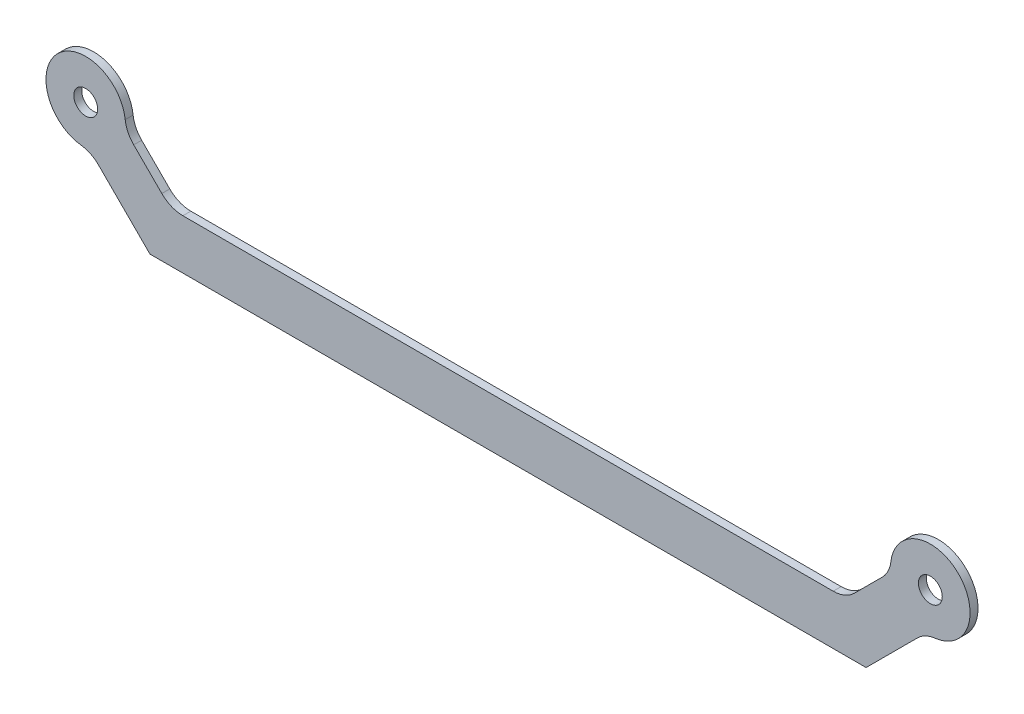
ISO-10303-21;
HEADER;
FILE_DESCRIPTION(('STEP AP214'),'2;1');
FILE_NAME('part.step','',(''),(''),'','','');
FILE_SCHEMA(('AUTOMOTIVE_DESIGN { 1 0 10303 214 1 1 1 1 }'));
ENDSEC;
DATA;
#1=APPLICATION_CONTEXT('core data for automotive mechanical design processes');
#2=APPLICATION_PROTOCOL_DEFINITION('international standard','automotive_design',2000,#1);
#3=PRODUCT_CONTEXT('',#1,'mechanical');
#4=PRODUCT('Part','Part','',(#3));
#5=PRODUCT_RELATED_PRODUCT_CATEGORY('part','',(#4));
#6=PRODUCT_DEFINITION_FORMATION('','',#4);
#7=PRODUCT_DEFINITION_CONTEXT('part definition',#1,'design');
#8=PRODUCT_DEFINITION('design','',#6,#7);
#9=PRODUCT_DEFINITION_SHAPE('','',#8);
#10=(LENGTH_UNIT() NAMED_UNIT(*) SI_UNIT(.MILLI.,.METRE.));
#11=(NAMED_UNIT(*) PLANE_ANGLE_UNIT() SI_UNIT($,.RADIAN.));
#12=(NAMED_UNIT(*) SI_UNIT($,.STERADIAN.) SOLID_ANGLE_UNIT());
#13=UNCERTAINTY_MEASURE_WITH_UNIT(LENGTH_MEASURE(1.E-05),#10,'distance_accuracy_value','');
#14=(GEOMETRIC_REPRESENTATION_CONTEXT(3) GLOBAL_UNCERTAINTY_ASSIGNED_CONTEXT((#13)) GLOBAL_UNIT_ASSIGNED_CONTEXT((#10,
#11,#12)) REPRESENTATION_CONTEXT('',''));
#15=CARTESIAN_POINT('',(0.,0.,0.));
#16=DIRECTION('',(0.,0.,1.));
#17=DIRECTION('',(1.,0.,0.));
#18=AXIS2_PLACEMENT_3D('',#15,#16,#17);
#19=CARTESIAN_POINT('',(-44.2677669529664,-1.76776695296639,0.8));
#20=DIRECTION('',(0.707106781186539,0.707106781186556,0.));
#21=DIRECTION('',(-0.707106781186556,0.707106781186539,0.));
#22=AXIS2_PLACEMENT_3D('',#19,#20,#21);
#23=PLANE('',#22);
#24=DIRECTION('',(0.707106781186556,-0.707106781186539,0.));
#25=VECTOR('',#24,1.);
#26=CARTESIAN_POINT('',(-44.2677669529664,-1.76776695296639,0.8));
#27=LINE('',#26,#25);
#28=CARTESIAN_POINT('',(-41.2059047744873,-4.82962913144533,0.8));
#29=VERTEX_POINT('',#28);
#30=CARTESIAN_POINT('',(-36.0355339059327,-9.99999999999982,0.8));
#31=VERTEX_POINT('',#30);
#32=EDGE_CURVE('E132',#29,#31,#27,.T.);
#33=ORIENTED_EDGE('',*,*,#32,.F.);
#34=DIRECTION('',(0.,0.,1.));
#35=VECTOR('',#34,1.);
#36=CARTESIAN_POINT('',(-41.2059047744873,-4.82962913144533,0.8));
#37=LINE('',#36,#35);
#38=CARTESIAN_POINT('',(-41.2059047744873,-4.82962913144533,0.));
#39=VERTEX_POINT('',#38);
#40=EDGE_CURVE('E197',#29,#39,#37,.F.);
#41=ORIENTED_EDGE('',*,*,#40,.T.);
#42=DIRECTION('',(0.707106781186556,-0.707106781186539,0.));
#43=VECTOR('',#42,1.);
#44=CARTESIAN_POINT('',(-44.2677669529664,-1.76776695296639,0.));
#45=LINE('',#44,#43);
#46=CARTESIAN_POINT('',(-36.0355339059327,-9.99999999999982,0.));
#47=VERTEX_POINT('',#46);
#48=EDGE_CURVE('E150',#39,#47,#45,.T.);
#49=ORIENTED_EDGE('',*,*,#48,.T.);
#50=DIRECTION('',(0.,0.,-1.));
#51=VECTOR('',#50,1.);
#52=CARTESIAN_POINT('',(-36.0355339059327,-9.99999999999982,0.8));
#53=LINE('',#52,#51);
#54=EDGE_CURVE('E148',#31,#47,#53,.T.);
#55=ORIENTED_EDGE('',*,*,#54,.F.);
#56=EDGE_LOOP('',(#33,#41,#49,#55));
#57=FACE_BOUND('',#56,.T.);
#58=ADVANCED_FACE('F32',(#57),#23,.F.);
#59=CARTESIAN_POINT('',(-36.0355339059327,-9.99999999999982,0.8));
#60=DIRECTION('',(0.,1.,0.));
#61=DIRECTION('',(0.,0.,1.));
#62=AXIS2_PLACEMENT_3D('',#59,#60,#61);
#63=PLANE('',#62);
#64=DIRECTION('',(1.,0.,0.));
#65=VECTOR('',#64,1.);
#66=CARTESIAN_POINT('',(-36.0355339059327,-9.99999999999982,0.));
#67=LINE('',#66,#65);
#68=CARTESIAN_POINT('',(36.0355339059327,-9.99999999999982,0.));
#69=VERTEX_POINT('',#68);
#70=EDGE_CURVE('E172',#47,#69,#67,.T.);
#71=ORIENTED_EDGE('',*,*,#70,.T.);
#72=DIRECTION('',(0.,0.,-1.));
#73=VECTOR('',#72,1.);
#74=CARTESIAN_POINT('',(36.0355339059327,-9.99999999999982,0.8));
#75=LINE('',#74,#73);
#76=CARTESIAN_POINT('',(36.0355339059327,-9.99999999999982,0.8));
#77=VERTEX_POINT('',#76);
#78=EDGE_CURVE('E154',#77,#69,#75,.T.);
#79=ORIENTED_EDGE('',*,*,#78,.F.);
#80=DIRECTION('',(1.,0.,0.));
#81=VECTOR('',#80,1.);
#82=CARTESIAN_POINT('',(-36.0355339059327,-9.99999999999982,0.8));
#83=LINE('',#82,#81);
#84=EDGE_CURVE('E137',#31,#77,#83,.T.);
#85=ORIENTED_EDGE('',*,*,#84,.F.);
#86=ORIENTED_EDGE('',*,*,#54,.T.);
#87=EDGE_LOOP('',(#71,#79,#85,#86));
#88=FACE_BOUND('',#87,.T.);
#89=ADVANCED_FACE('F156',(#88),#63,.F.);
#90=CARTESIAN_POINT('',(44.2677669529664,-1.76776695296638,0.8));
#91=DIRECTION('',(-0.707106781186539,0.707106781186556,0.));
#92=DIRECTION('',(-0.707106781186556,-0.707106781186539,0.));
#93=AXIS2_PLACEMENT_3D('',#90,#91,#92);
#94=PLANE('',#93);
#95=DIRECTION('',(0.707106781186556,0.707106781186539,0.));
#96=VECTOR('',#95,1.);
#97=CARTESIAN_POINT('',(44.2677669529664,-1.76776695296638,0.));
#98=LINE('',#97,#96);
#99=CARTESIAN_POINT('',(41.2059047744874,-4.82962913144531,0.));
#100=VERTEX_POINT('',#99);
#101=EDGE_CURVE('E175',#69,#100,#98,.T.);
#102=ORIENTED_EDGE('',*,*,#101,.T.);
#103=DIRECTION('',(0.,0.,1.));
#104=VECTOR('',#103,1.);
#105=CARTESIAN_POINT('',(41.2059047744874,-4.82962913144531,0.8));
#106=LINE('',#105,#104);
#107=CARTESIAN_POINT('',(41.2059047744874,-4.82962913144531,0.8));
#108=VERTEX_POINT('',#107);
#109=EDGE_CURVE('E194',#100,#108,#106,.T.);
#110=ORIENTED_EDGE('',*,*,#109,.T.);
#111=DIRECTION('',(0.707106781186556,0.707106781186539,0.));
#112=VECTOR('',#111,1.);
#113=CARTESIAN_POINT('',(44.2677669529664,-1.76776695296638,0.8));
#114=LINE('',#113,#112);
#115=EDGE_CURVE('E159',#77,#108,#114,.T.);
#116=ORIENTED_EDGE('',*,*,#115,.F.);
#117=ORIENTED_EDGE('',*,*,#78,.T.);
#118=EDGE_LOOP('',(#102,#110,#116,#117));
#119=FACE_BOUND('',#118,.T.);
#120=ADVANCED_FACE('F304',(#119),#94,.F.);
#121=CARTESIAN_POINT('',(40.7322330470337,1.7677669529664,0.8));
#122=DIRECTION('',(0.707106781186539,-0.707106781186556,0.));
#123=DIRECTION('',(0.707106781186556,0.707106781186539,0.));
#124=AXIS2_PLACEMENT_3D('',#121,#122,#123);
#125=PLANE('',#124);
#126=DIRECTION('',(-0.707106781186556,-0.707106781186539,0.));
#127=VECTOR('',#126,1.);
#128=CARTESIAN_POINT('',(40.7322330470337,1.7677669529664,0.8));
#129=LINE('',#128,#127);
#130=CARTESIAN_POINT('',(37.6703708685546,-1.29409522551253,0.8));
#131=VERTEX_POINT('',#130);
#132=CARTESIAN_POINT('',(34.8431457505076,-4.12132034355948,0.8));
#133=VERTEX_POINT('',#132);
#134=EDGE_CURVE('E161',#131,#133,#129,.T.);
#135=ORIENTED_EDGE('',*,*,#134,.F.);
#136=DIRECTION('',(0.,0.,1.));
#137=VECTOR('',#136,1.);
#138=CARTESIAN_POINT('',(37.6703708685546,-1.29409522551253,0.8));
#139=LINE('',#138,#137);
#140=CARTESIAN_POINT('',(37.6703708685546,-1.29409522551253,0.));
#141=VERTEX_POINT('',#140);
#142=EDGE_CURVE('E187',#131,#141,#139,.F.);
#143=ORIENTED_EDGE('',*,*,#142,.T.);
#144=DIRECTION('',(-0.707106781186556,-0.707106781186539,0.));
#145=VECTOR('',#144,1.);
#146=CARTESIAN_POINT('',(40.7322330470337,1.7677669529664,0.));
#147=LINE('',#146,#145);
#148=CARTESIAN_POINT('',(34.8431457505076,-4.12132034355948,0.));
#149=VERTEX_POINT('',#148);
#150=EDGE_CURVE('E178',#141,#149,#147,.T.);
#151=ORIENTED_EDGE('',*,*,#150,.T.);
#152=DIRECTION('',(0.,0.,-1.));
#153=VECTOR('',#152,1.);
#154=CARTESIAN_POINT('',(34.8431457505076,-4.12132034355948,0.8));
#155=LINE('',#154,#153);
#156=EDGE_CURVE('E153',#149,#133,#155,.F.);
#157=ORIENTED_EDGE('',*,*,#156,.T.);
#158=EDGE_LOOP('',(#135,#143,#151,#157));
#159=FACE_BOUND('',#158,.T.);
#160=ADVANCED_FACE('F330',(#159),#125,.F.);
#161=CARTESIAN_POINT('',(-33.9644660940673,-4.99999999999982,0.8));
#162=DIRECTION('',(0.,-1.,0.));
#163=DIRECTION('',(0.,0.,-1.));
#164=AXIS2_PLACEMENT_3D('',#161,#162,#163);
#165=PLANE('',#164);
#166=DIRECTION('',(-1.,0.,0.));
#167=VECTOR('',#166,1.);
#168=CARTESIAN_POINT('',(-33.9644660940673,-4.99999999999982,0.8));
#169=LINE('',#168,#167);
#170=CARTESIAN_POINT('',(32.721825406948,-4.99999999999982,0.8));
#171=VERTEX_POINT('',#170);
#172=CARTESIAN_POINT('',(-32.721825406948,-4.99999999999982,0.8));
#173=VERTEX_POINT('',#172);
#174=EDGE_CURVE('E166',#171,#173,#169,.T.);
#175=ORIENTED_EDGE('',*,*,#174,.F.);
#176=DIRECTION('',(0.,0.,-1.));
#177=VECTOR('',#176,1.);
#178=CARTESIAN_POINT('',(32.721825406948,-4.99999999999982,0.));
#179=LINE('',#178,#177);
#180=CARTESIAN_POINT('',(32.721825406948,-4.99999999999982,0.));
#181=VERTEX_POINT('',#180);
#182=EDGE_CURVE('E210',#171,#181,#179,.T.);
#183=ORIENTED_EDGE('',*,*,#182,.T.);
#184=DIRECTION('',(-1.,0.,0.));
#185=VECTOR('',#184,1.);
#186=CARTESIAN_POINT('',(-33.9644660940673,-4.99999999999982,0.));
#187=LINE('',#186,#185);
#188=CARTESIAN_POINT('',(-32.721825406948,-4.99999999999982,0.));
#189=VERTEX_POINT('',#188);
#190=EDGE_CURVE('E181',#181,#189,#187,.T.);
#191=ORIENTED_EDGE('',*,*,#190,.T.);
#192=DIRECTION('',(0.,0.,-1.));
#193=VECTOR('',#192,1.);
#194=CARTESIAN_POINT('',(-32.721825406948,-4.99999999999982,0.8));
#195=LINE('',#194,#193);
#196=EDGE_CURVE('E47',#189,#173,#195,.F.);
#197=ORIENTED_EDGE('',*,*,#196,.T.);
#198=EDGE_LOOP('',(#175,#183,#191,#197));
#199=FACE_BOUND('',#198,.T.);
#200=ADVANCED_FACE('F237',(#199),#165,.F.);
#201=CARTESIAN_POINT('',(-40.7322330470337,1.76776695296639,0.8));
#202=DIRECTION('',(-0.707106781186539,-0.707106781186556,0.));
#203=DIRECTION('',(0.707106781186556,-0.707106781186539,0.));
#204=AXIS2_PLACEMENT_3D('',#201,#202,#203);
#205=PLANE('',#204);
#206=DIRECTION('',(-0.707106781186556,0.707106781186539,0.));
#207=VECTOR('',#206,1.);
#208=CARTESIAN_POINT('',(-40.7322330470337,1.76776695296639,0.));
#209=LINE('',#208,#207);
#210=CARTESIAN_POINT('',(-34.8431457505076,-4.12132034355949,0.));
#211=VERTEX_POINT('',#210);
#212=CARTESIAN_POINT('',(-37.6703708685546,-1.29409522551254,0.));
#213=VERTEX_POINT('',#212);
#214=EDGE_CURVE('E145',#211,#213,#209,.T.);
#215=ORIENTED_EDGE('',*,*,#214,.T.);
#216=DIRECTION('',(0.,0.,1.));
#217=VECTOR('',#216,1.);
#218=CARTESIAN_POINT('',(-37.6703708685546,-1.29409522551254,0.8));
#219=LINE('',#218,#217);
#220=CARTESIAN_POINT('',(-37.6703708685546,-1.29409522551254,0.8));
#221=VERTEX_POINT('',#220);
#222=EDGE_CURVE('E206',#213,#221,#219,.T.);
#223=ORIENTED_EDGE('',*,*,#222,.T.);
#224=DIRECTION('',(-0.707106781186556,0.707106781186539,0.));
#225=VECTOR('',#224,1.);
#226=CARTESIAN_POINT('',(-40.7322330470337,1.76776695296639,0.8));
#227=LINE('',#226,#225);
#228=CARTESIAN_POINT('',(-34.8431457505076,-4.12132034355949,0.8));
#229=VERTEX_POINT('',#228);
#230=EDGE_CURVE('E168',#229,#221,#227,.T.);
#231=ORIENTED_EDGE('',*,*,#230,.F.);
#232=DIRECTION('',(0.,0.,-1.));
#233=VECTOR('',#232,1.);
#234=CARTESIAN_POINT('',(-34.8431457505076,-4.12132034355949,0.));
#235=LINE('',#234,#233);
#236=EDGE_CURVE('E203',#229,#211,#235,.T.);
#237=ORIENTED_EDGE('',*,*,#236,.T.);
#238=EDGE_LOOP('',(#215,#223,#231,#237));
#239=FACE_BOUND('',#238,.T.);
#240=ADVANCED_FACE('F242',(#239),#205,.F.);
#241=CARTESIAN_POINT('',(-42.5,0.,0.8));
#242=DIRECTION('',(0.,0.,1.));
#243=DIRECTION('',(1.,0.,0.));
#244=AXIS2_PLACEMENT_3D('',#241,#242,#243);
#245=PLANE('',#244);
#246=CARTESIAN_POINT('',(-42.5,0.,0.8));
#247=DIRECTION('',(0.,0.,1.));
#248=DIRECTION('',(1.,0.,0.));
#249=AXIS2_PLACEMENT_3D('',#246,#247,#248);
#250=CIRCLE('',#249,1.2);
#251=CARTESIAN_POINT('',(-41.3,0.,0.8));
#252=VERTEX_POINT('',#251);
#253=EDGE_CURVE('E272',#252,#252,#250,.T.);
#254=ORIENTED_EDGE('',*,*,#253,.F.);
#255=EDGE_LOOP('',(#254));
#256=FACE_BOUND('',#255,.T.);
#257=CARTESIAN_POINT('',(42.5,0.,0.8));
#258=DIRECTION('',(0.,0.,1.));
#259=DIRECTION('',(1.,0.,0.));
#260=AXIS2_PLACEMENT_3D('',#257,#258,#259);
#261=CIRCLE('',#260,1.2);
#262=CARTESIAN_POINT('',(43.7,0.,0.8));
#263=VERTEX_POINT('',#262);
#264=EDGE_CURVE('E266',#263,#263,#261,.T.);
#265=ORIENTED_EDGE('',*,*,#264,.F.);
#266=EDGE_LOOP('',(#265));
#267=FACE_BOUND('',#266,.T.);
#268=ORIENTED_EDGE('',*,*,#115,.T.);
#269=CARTESIAN_POINT('',(43.327225118047,-6.95094947500498,0.8));
#270=DIRECTION('',(0.,0.,1.));
#271=DIRECTION('',(1.,0.,0.));
#272=AXIS2_PLACEMENT_3D('',#269,#270,#271);
#273=CIRCLE('',#272,3.);
#274=CARTESIAN_POINT('',(42.9727000674554,-3.97197112857427,0.8));
#275=VERTEX_POINT('',#274);
#276=EDGE_CURVE('E217',#108,#275,#273,.F.);
#277=ORIENTED_EDGE('',*,*,#276,.T.);
#278=CARTESIAN_POINT('',(42.5,0.,0.8));
#279=DIRECTION('',(0.,0.,1.));
#280=DIRECTION('',(1.,0.,0.));
#281=AXIS2_PLACEMENT_3D('',#278,#279,#280);
#282=CIRCLE('',#281,4.);
#283=CARTESIAN_POINT('',(38.5280288714257,0.472700067455509,0.8));
#284=VERTEX_POINT('',#283);
#285=EDGE_CURVE('E258',#275,#284,#282,.T.);
#286=ORIENTED_EDGE('',*,*,#285,.T.);
#287=CARTESIAN_POINT('',(35.549050524995,0.827225118047131,0.8));
#288=DIRECTION('',(0.,0.,1.));
#289=DIRECTION('',(1.,0.,0.));
#290=AXIS2_PLACEMENT_3D('',#287,#288,#289);
#291=CIRCLE('',#290,3.);
#292=EDGE_CURVE('E215',#284,#131,#291,.F.);
#293=ORIENTED_EDGE('',*,*,#292,.T.);
#294=ORIENTED_EDGE('',*,*,#134,.T.);
#295=CARTESIAN_POINT('',(32.721825406948,-1.99999999999982,0.8));
#296=DIRECTION('',(0.,0.,1.));
#297=DIRECTION('',(1.,0.,0.));
#298=AXIS2_PLACEMENT_3D('',#295,#296,#297);
#299=CIRCLE('',#298,3.);
#300=EDGE_CURVE('E54',#133,#171,#299,.F.);
#301=ORIENTED_EDGE('',*,*,#300,.T.);
#302=ORIENTED_EDGE('',*,*,#174,.T.);
#303=CARTESIAN_POINT('',(-32.721825406948,-1.99999999999982,0.8));
#304=DIRECTION('',(0.,0.,1.));
#305=DIRECTION('',(1.,0.,0.));
#306=AXIS2_PLACEMENT_3D('',#303,#304,#305);
#307=CIRCLE('',#306,3.);
#308=EDGE_CURVE('E11',#173,#229,#307,.F.);
#309=ORIENTED_EDGE('',*,*,#308,.T.);
#310=ORIENTED_EDGE('',*,*,#230,.T.);
#311=CARTESIAN_POINT('',(-35.549050524995,0.827225118047125,0.8));
#312=DIRECTION('',(0.,0.,1.));
#313=DIRECTION('',(1.,0.,0.));
#314=AXIS2_PLACEMENT_3D('',#311,#312,#313);
#315=CIRCLE('',#314,3.);
#316=CARTESIAN_POINT('',(-38.5280288714257,0.472700067455501,0.8));
#317=VERTEX_POINT('',#316);
#318=EDGE_CURVE('E224',#221,#317,#315,.F.);
#319=ORIENTED_EDGE('',*,*,#318,.T.);
#320=CARTESIAN_POINT('',(-42.5,0.,0.8));
#321=DIRECTION('',(0.,0.,1.));
#322=DIRECTION('',(1.,0.,0.));
#323=AXIS2_PLACEMENT_3D('',#320,#321,#322);
#324=CIRCLE('',#323,4.);
#325=CARTESIAN_POINT('',(-42.9727000674554,-3.97197112857428,0.8));
#326=VERTEX_POINT('',#325);
#327=EDGE_CURVE('E249',#317,#326,#324,.T.);
#328=ORIENTED_EDGE('',*,*,#327,.T.);
#329=CARTESIAN_POINT('',(-43.327225118047,-6.95094947500499,0.8));
#330=DIRECTION('',(0.,0.,1.));
#331=DIRECTION('',(1.,0.,0.));
#332=AXIS2_PLACEMENT_3D('',#329,#330,#331);
#333=CIRCLE('',#332,3.);
#334=EDGE_CURVE('E141',#326,#29,#333,.F.);
#335=ORIENTED_EDGE('',*,*,#334,.T.);
#336=ORIENTED_EDGE('',*,*,#32,.T.);
#337=ORIENTED_EDGE('',*,*,#84,.T.);
#338=EDGE_LOOP('',(#268,#277,#286,#293,#294,#301,#302,#309,#310,#319,#328,#335,#336,#337));
#339=FACE_BOUND('',#338,.T.);
#340=ADVANCED_FACE('F135',(#256,#267,#339),#245,.T.);
#341=CARTESIAN_POINT('',(-42.5,0.,0.));
#342=DIRECTION('',(0.,0.,1.));
#343=DIRECTION('',(1.,0.,0.));
#344=AXIS2_PLACEMENT_3D('',#341,#342,#343);
#345=PLANE('',#344);
#346=CARTESIAN_POINT('',(-42.5,0.,0.));
#347=DIRECTION('',(0.,0.,1.));
#348=DIRECTION('',(1.,0.,0.));
#349=AXIS2_PLACEMENT_3D('',#346,#347,#348);
#350=CIRCLE('',#349,1.2);
#351=CARTESIAN_POINT('',(-41.3,0.,0.));
#352=VERTEX_POINT('',#351);
#353=EDGE_CURVE('E269',#352,#352,#350,.T.);
#354=ORIENTED_EDGE('',*,*,#353,.T.);
#355=EDGE_LOOP('',(#354));
#356=FACE_BOUND('',#355,.T.);
#357=CARTESIAN_POINT('',(42.5,0.,0.));
#358=DIRECTION('',(0.,0.,1.));
#359=DIRECTION('',(1.,0.,0.));
#360=AXIS2_PLACEMENT_3D('',#357,#358,#359);
#361=CIRCLE('',#360,1.2);
#362=CARTESIAN_POINT('',(43.7,0.,0.));
#363=VERTEX_POINT('',#362);
#364=EDGE_CURVE('E263',#363,#363,#361,.T.);
#365=ORIENTED_EDGE('',*,*,#364,.T.);
#366=EDGE_LOOP('',(#365));
#367=FACE_BOUND('',#366,.T.);
#368=ORIENTED_EDGE('',*,*,#150,.F.);
#369=CARTESIAN_POINT('',(35.549050524995,0.827225118047131,0.));
#370=DIRECTION('',(0.,0.,1.));
#371=DIRECTION('',(1.,0.,0.));
#372=AXIS2_PLACEMENT_3D('',#369,#370,#371);
#373=CIRCLE('',#372,3.);
#374=CARTESIAN_POINT('',(38.5280288714257,0.472700067455509,0.));
#375=VERTEX_POINT('',#374);
#376=EDGE_CURVE('E213',#141,#375,#373,.T.);
#377=ORIENTED_EDGE('',*,*,#376,.T.);
#378=CARTESIAN_POINT('',(42.5,0.,0.));
#379=DIRECTION('',(0.,0.,1.));
#380=DIRECTION('',(1.,0.,0.));
#381=AXIS2_PLACEMENT_3D('',#378,#379,#380);
#382=CIRCLE('',#381,4.);
#383=CARTESIAN_POINT('',(42.9727000674554,-3.97197112857427,0.));
#384=VERTEX_POINT('',#383);
#385=EDGE_CURVE('E255',#375,#384,#382,.F.);
#386=ORIENTED_EDGE('',*,*,#385,.T.);
#387=CARTESIAN_POINT('',(43.327225118047,-6.95094947500498,0.));
#388=DIRECTION('',(0.,0.,1.));
#389=DIRECTION('',(1.,0.,0.));
#390=AXIS2_PLACEMENT_3D('',#387,#388,#389);
#391=CIRCLE('',#390,3.);
#392=EDGE_CURVE('E219',#384,#100,#391,.T.);
#393=ORIENTED_EDGE('',*,*,#392,.T.);
#394=ORIENTED_EDGE('',*,*,#101,.F.);
#395=ORIENTED_EDGE('',*,*,#70,.F.);
#396=ORIENTED_EDGE('',*,*,#48,.F.);
#397=CARTESIAN_POINT('',(-43.327225118047,-6.95094947500499,0.));
#398=DIRECTION('',(0.,0.,1.));
#399=DIRECTION('',(1.,0.,0.));
#400=AXIS2_PLACEMENT_3D('',#397,#398,#399);
#401=CIRCLE('',#400,3.);
#402=CARTESIAN_POINT('',(-42.9727000674554,-3.97197112857428,0.));
#403=VERTEX_POINT('',#402);
#404=EDGE_CURVE('E221',#39,#403,#401,.T.);
#405=ORIENTED_EDGE('',*,*,#404,.T.);
#406=CARTESIAN_POINT('',(-42.5,0.,0.));
#407=DIRECTION('',(0.,0.,1.));
#408=DIRECTION('',(1.,0.,0.));
#409=AXIS2_PLACEMENT_3D('',#406,#407,#408);
#410=CIRCLE('',#409,4.);
#411=CARTESIAN_POINT('',(-38.5280288714257,0.472700067455501,0.));
#412=VERTEX_POINT('',#411);
#413=EDGE_CURVE('E173',#403,#412,#410,.F.);
#414=ORIENTED_EDGE('',*,*,#413,.T.);
#415=CARTESIAN_POINT('',(-35.549050524995,0.827225118047125,0.));
#416=DIRECTION('',(0.,0.,1.));
#417=DIRECTION('',(1.,0.,0.));
#418=AXIS2_PLACEMENT_3D('',#415,#416,#417);
#419=CIRCLE('',#418,3.);
#420=EDGE_CURVE('E226',#412,#213,#419,.T.);
#421=ORIENTED_EDGE('',*,*,#420,.T.);
#422=ORIENTED_EDGE('',*,*,#214,.F.);
#423=CARTESIAN_POINT('',(-32.721825406948,-1.99999999999982,0.));
#424=DIRECTION('',(0.,0.,1.));
#425=DIRECTION('',(1.,0.,0.));
#426=AXIS2_PLACEMENT_3D('',#423,#424,#425);
#427=CIRCLE('',#426,3.);
#428=EDGE_CURVE('E40',#211,#189,#427,.T.);
#429=ORIENTED_EDGE('',*,*,#428,.T.);
#430=ORIENTED_EDGE('',*,*,#190,.F.);
#431=CARTESIAN_POINT('',(32.721825406948,-1.99999999999982,0.));
#432=DIRECTION('',(0.,0.,1.));
#433=DIRECTION('',(1.,0.,0.));
#434=AXIS2_PLACEMENT_3D('',#431,#432,#433);
#435=CIRCLE('',#434,3.);
#436=EDGE_CURVE('E228',#181,#149,#435,.T.);
#437=ORIENTED_EDGE('',*,*,#436,.T.);
#438=EDGE_LOOP('',(#368,#377,#386,#393,#394,#395,#396,#405,#414,#421,#422,#429,#430,#437));
#439=FACE_BOUND('',#438,.T.);
#440=ADVANCED_FACE('F234',(#356,#367,#439),#345,.F.);
#441=CARTESIAN_POINT('',(-42.5,0.,-11.3137084989848));
#442=DIRECTION('',(0.,0.,1.));
#443=DIRECTION('',(1.,0.,0.));
#444=AXIS2_PLACEMENT_3D('',#441,#442,#443);
#445=CYLINDRICAL_SURFACE('',#444,4.);
#446=ORIENTED_EDGE('',*,*,#413,.F.);
#447=DIRECTION('',(0.,0.,1.));
#448=VECTOR('',#447,1.);
#449=CARTESIAN_POINT('',(-42.9727000674554,-3.97197112857428,-11.3137084989848));
#450=LINE('',#449,#448);
#451=EDGE_CURVE('E201',#403,#326,#450,.T.);
#452=ORIENTED_EDGE('',*,*,#451,.T.);
#453=ORIENTED_EDGE('',*,*,#327,.F.);
#454=DIRECTION('',(0.,0.,1.));
#455=VECTOR('',#454,1.);
#456=CARTESIAN_POINT('',(-38.5280288714257,0.4727000674555,-11.3137084989848));
#457=LINE('',#456,#455);
#458=EDGE_CURVE('E199',#317,#412,#457,.F.);
#459=ORIENTED_EDGE('',*,*,#458,.T.);
#460=EDGE_LOOP('',(#446,#452,#453,#459));
#461=FACE_BOUND('',#460,.T.);
#462=ADVANCED_FACE('F252',(#461),#445,.T.);
#463=CARTESIAN_POINT('',(42.5,0.,-11.3137084989848));
#464=DIRECTION('',(0.,0.,1.));
#465=DIRECTION('',(1.,0.,0.));
#466=AXIS2_PLACEMENT_3D('',#463,#464,#465);
#467=CYLINDRICAL_SURFACE('',#466,4.);
#468=ORIENTED_EDGE('',*,*,#385,.F.);
#469=DIRECTION('',(0.,0.,1.));
#470=VECTOR('',#469,1.);
#471=CARTESIAN_POINT('',(38.5280288714257,0.472700067455508,-11.3137084989848));
#472=LINE('',#471,#470);
#473=EDGE_CURVE('E192',#375,#284,#472,.T.);
#474=ORIENTED_EDGE('',*,*,#473,.T.);
#475=ORIENTED_EDGE('',*,*,#285,.F.);
#476=DIRECTION('',(0.,0.,1.));
#477=VECTOR('',#476,1.);
#478=CARTESIAN_POINT('',(42.9727000674554,-3.97197112857427,-11.3137084989848));
#479=LINE('',#478,#477);
#480=EDGE_CURVE('E190',#275,#384,#479,.F.);
#481=ORIENTED_EDGE('',*,*,#480,.T.);
#482=EDGE_LOOP('',(#468,#474,#475,#481));
#483=FACE_BOUND('',#482,.T.);
#484=ADVANCED_FACE('F296',(#483),#467,.T.);
#485=CARTESIAN_POINT('',(35.549050524995,0.827225118047131,-11.3137084989848));
#486=DIRECTION('',(0.,0.,1.));
#487=DIRECTION('',(1.,0.,0.));
#488=AXIS2_PLACEMENT_3D('',#485,#486,#487);
#489=CYLINDRICAL_SURFACE('',#488,3.);
#490=ORIENTED_EDGE('',*,*,#292,.F.);
#491=ORIENTED_EDGE('',*,*,#473,.F.);
#492=ORIENTED_EDGE('',*,*,#376,.F.);
#493=ORIENTED_EDGE('',*,*,#142,.F.);
#494=EDGE_LOOP('',(#490,#491,#492,#493));
#495=FACE_BOUND('',#494,.T.);
#496=ADVANCED_FACE('F308',(#495),#489,.F.);
#497=CARTESIAN_POINT('',(43.327225118047,-6.95094947500498,-11.3137084989848));
#498=DIRECTION('',(0.,0.,1.));
#499=DIRECTION('',(1.,0.,0.));
#500=AXIS2_PLACEMENT_3D('',#497,#498,#499);
#501=CYLINDRICAL_SURFACE('',#500,3.);
#502=ORIENTED_EDGE('',*,*,#392,.F.);
#503=ORIENTED_EDGE('',*,*,#480,.F.);
#504=ORIENTED_EDGE('',*,*,#276,.F.);
#505=ORIENTED_EDGE('',*,*,#109,.F.);
#506=EDGE_LOOP('',(#502,#503,#504,#505));
#507=FACE_BOUND('',#506,.T.);
#508=ADVANCED_FACE('F311',(#507),#501,.F.);
#509=CARTESIAN_POINT('',(-43.327225118047,-6.95094947500499,-11.3137084989848));
#510=DIRECTION('',(0.,0.,1.));
#511=DIRECTION('',(1.,0.,0.));
#512=AXIS2_PLACEMENT_3D('',#509,#510,#511);
#513=CYLINDRICAL_SURFACE('',#512,3.);
#514=ORIENTED_EDGE('',*,*,#334,.F.);
#515=ORIENTED_EDGE('',*,*,#451,.F.);
#516=ORIENTED_EDGE('',*,*,#404,.F.);
#517=ORIENTED_EDGE('',*,*,#40,.F.);
#518=EDGE_LOOP('',(#514,#515,#516,#517));
#519=FACE_BOUND('',#518,.T.);
#520=ADVANCED_FACE('F315',(#519),#513,.F.);
#521=CARTESIAN_POINT('',(-35.549050524995,0.827225118047125,-11.3137084989848));
#522=DIRECTION('',(0.,0.,1.));
#523=DIRECTION('',(1.,0.,0.));
#524=AXIS2_PLACEMENT_3D('',#521,#522,#523);
#525=CYLINDRICAL_SURFACE('',#524,3.);
#526=ORIENTED_EDGE('',*,*,#420,.F.);
#527=ORIENTED_EDGE('',*,*,#458,.F.);
#528=ORIENTED_EDGE('',*,*,#318,.F.);
#529=ORIENTED_EDGE('',*,*,#222,.F.);
#530=EDGE_LOOP('',(#526,#527,#528,#529));
#531=FACE_BOUND('',#530,.T.);
#532=ADVANCED_FACE('F246',(#531),#525,.F.);
#533=CARTESIAN_POINT('',(32.721825406948,-1.99999999999982,0.8));
#534=DIRECTION('',(0.,0.,1.));
#535=DIRECTION('',(1.,0.,0.));
#536=AXIS2_PLACEMENT_3D('',#533,#534,#535);
#537=CYLINDRICAL_SURFACE('',#536,3.);
#538=ORIENTED_EDGE('',*,*,#300,.F.);
#539=ORIENTED_EDGE('',*,*,#156,.F.);
#540=ORIENTED_EDGE('',*,*,#436,.F.);
#541=ORIENTED_EDGE('',*,*,#182,.F.);
#542=EDGE_LOOP('',(#538,#539,#540,#541));
#543=FACE_BOUND('',#542,.T.);
#544=ADVANCED_FACE('F321',(#543),#537,.F.);
#545=CARTESIAN_POINT('',(-32.721825406948,-1.99999999999982,0.8));
#546=DIRECTION('',(0.,0.,1.));
#547=DIRECTION('',(1.,0.,0.));
#548=AXIS2_PLACEMENT_3D('',#545,#546,#547);
#549=CYLINDRICAL_SURFACE('',#548,3.);
#550=ORIENTED_EDGE('',*,*,#308,.F.);
#551=ORIENTED_EDGE('',*,*,#196,.F.);
#552=ORIENTED_EDGE('',*,*,#428,.F.);
#553=ORIENTED_EDGE('',*,*,#236,.F.);
#554=EDGE_LOOP('',(#550,#551,#552,#553));
#555=FACE_BOUND('',#554,.T.);
#556=ADVANCED_FACE('F34',(#555),#549,.F.);
#557=CARTESIAN_POINT('',(42.5,0.,0.8));
#558=DIRECTION('',(0.,0.,1.));
#559=DIRECTION('',(1.,0.,0.));
#560=AXIS2_PLACEMENT_3D('',#557,#558,#559);
#561=CYLINDRICAL_SURFACE('',#560,1.2);
#562=ORIENTED_EDGE('',*,*,#264,.T.);
#563=EDGE_LOOP('',(#562));
#564=FACE_BOUND('',#563,.T.);
#565=ORIENTED_EDGE('',*,*,#364,.F.);
#566=EDGE_LOOP('',(#565));
#567=FACE_BOUND('',#566,.T.);
#568=ADVANCED_FACE('F284',(#564,#567),#561,.F.);
#569=CARTESIAN_POINT('',(-42.5,0.,0.8));
#570=DIRECTION('',(0.,0.,1.));
#571=DIRECTION('',(1.,0.,0.));
#572=AXIS2_PLACEMENT_3D('',#569,#570,#571);
#573=CYLINDRICAL_SURFACE('',#572,1.2);
#574=ORIENTED_EDGE('',*,*,#253,.T.);
#575=EDGE_LOOP('',(#574));
#576=FACE_BOUND('',#575,.T.);
#577=ORIENTED_EDGE('',*,*,#353,.F.);
#578=EDGE_LOOP('',(#577));
#579=FACE_BOUND('',#578,.T.);
#580=ADVANCED_FACE('F276',(#576,#579),#573,.F.);
#581=CLOSED_SHELL('',(#58,#89,#120,#160,#200,#240,#340,#440,#462,#484,#496,#508,#520,#532,#544,
#556,#568,#580));
#582=MANIFOLD_SOLID_BREP('B2',#581);
#583=ADVANCED_BREP_SHAPE_REPRESENTATION('',(#18,#582),#14);
#584=SHAPE_DEFINITION_REPRESENTATION(#9,#583);
ENDSEC;
END-ISO-10303-21;
